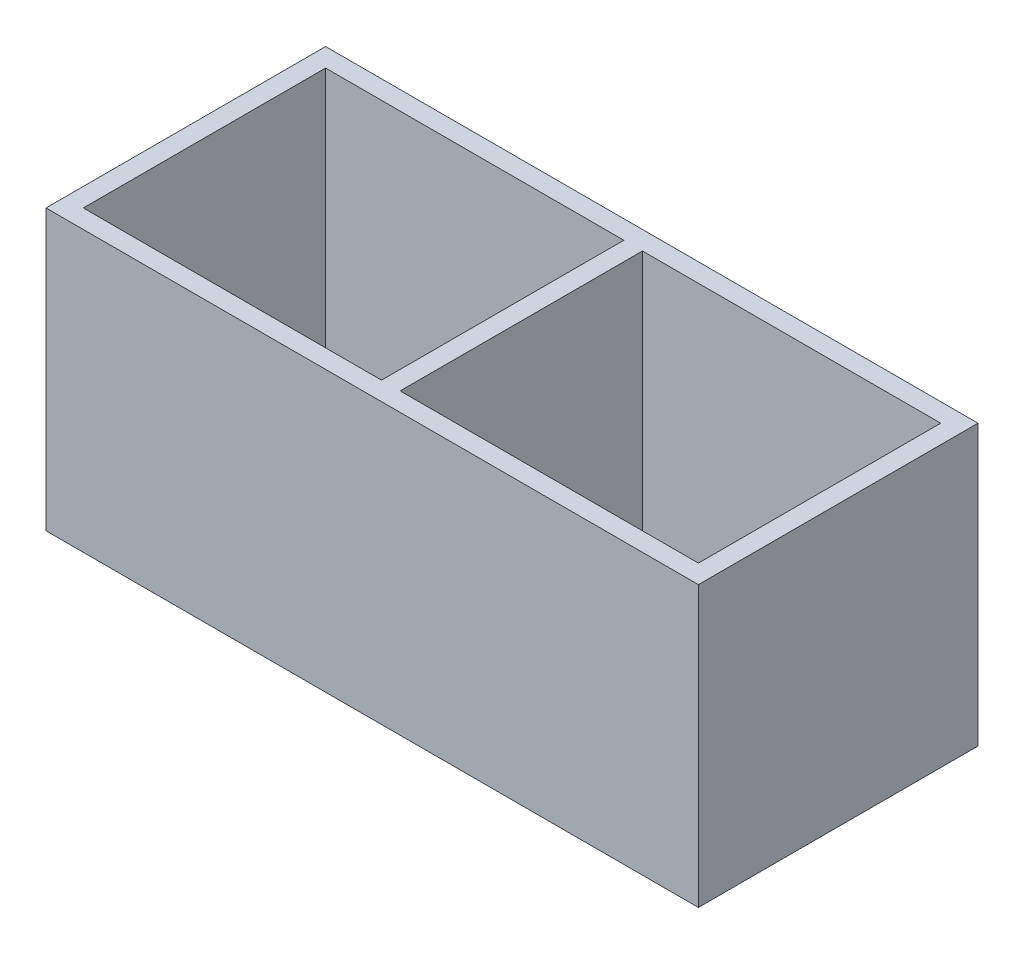
ISO-10303-21;
HEADER;
FILE_DESCRIPTION(('STEP AP214'),'2;1');
FILE_NAME('part.step','',(''),(''),'','','');
FILE_SCHEMA(('AUTOMOTIVE_DESIGN { 1 0 10303 214 1 1 1 1 }'));
ENDSEC;
DATA;
#1=APPLICATION_CONTEXT('core data for automotive mechanical design processes');
#2=APPLICATION_PROTOCOL_DEFINITION('international standard','automotive_design',2000,#1);
#3=PRODUCT_CONTEXT('',#1,'mechanical');
#4=PRODUCT('Part','Part','',(#3));
#5=PRODUCT_RELATED_PRODUCT_CATEGORY('part','',(#4));
#6=PRODUCT_DEFINITION_FORMATION('','',#4);
#7=PRODUCT_DEFINITION_CONTEXT('part definition',#1,'design');
#8=PRODUCT_DEFINITION('design','',#6,#7);
#9=PRODUCT_DEFINITION_SHAPE('','',#8);
#10=(LENGTH_UNIT() NAMED_UNIT(*) SI_UNIT(.MILLI.,.METRE.));
#11=(NAMED_UNIT(*) PLANE_ANGLE_UNIT() SI_UNIT($,.RADIAN.));
#12=(NAMED_UNIT(*) SI_UNIT($,.STERADIAN.) SOLID_ANGLE_UNIT());
#13=UNCERTAINTY_MEASURE_WITH_UNIT(LENGTH_MEASURE(1.E-05),#10,'distance_accuracy_value','');
#14=(GEOMETRIC_REPRESENTATION_CONTEXT(3) GLOBAL_UNCERTAINTY_ASSIGNED_CONTEXT((#13)) GLOBAL_UNIT_ASSIGNED_CONTEXT((#10,
#11,#12)) REPRESENTATION_CONTEXT('',''));
#15=CARTESIAN_POINT('',(0.,0.,0.));
#16=DIRECTION('',(0.,0.,1.));
#17=DIRECTION('',(1.,0.,0.));
#18=AXIS2_PLACEMENT_3D('',#15,#16,#17);
#19=CARTESIAN_POINT('',(0.,15.,0.));
#20=DIRECTION('',(0.,-1.,0.));
#21=DIRECTION('',(0.,0.,-1.));
#22=AXIS2_PLACEMENT_3D('',#19,#20,#21);
#23=PLANE('',#22);
#24=DIRECTION('',(-1.,0.,0.));
#25=VECTOR('',#24,1.);
#26=CARTESIAN_POINT('',(0.50000000000001,15.,-6.5));
#27=LINE('',#26,#25);
#28=CARTESIAN_POINT('',(16.5,15.,-6.5));
#29=VERTEX_POINT('',#28);
#30=CARTESIAN_POINT('',(0.50000000000001,15.,-6.5));
#31=VERTEX_POINT('',#30);
#32=EDGE_CURVE('E159',#29,#31,#27,.T.);
#33=ORIENTED_EDGE('',*,*,#32,.F.);
#34=DIRECTION('',(0.,0.,-1.));
#35=VECTOR('',#34,1.);
#36=CARTESIAN_POINT('',(16.5,15.,6.5));
#37=LINE('',#36,#35);
#38=CARTESIAN_POINT('',(16.5,15.,6.5));
#39=VERTEX_POINT('',#38);
#40=EDGE_CURVE('E167',#39,#29,#37,.T.);
#41=ORIENTED_EDGE('',*,*,#40,.F.);
#42=DIRECTION('',(1.,0.,0.));
#43=VECTOR('',#42,1.);
#44=CARTESIAN_POINT('',(0.50000000000001,15.,6.5));
#45=LINE('',#44,#43);
#46=CARTESIAN_POINT('',(0.50000000000001,15.,6.5));
#47=VERTEX_POINT('',#46);
#48=EDGE_CURVE('E164',#47,#39,#45,.T.);
#49=ORIENTED_EDGE('',*,*,#48,.F.);
#50=DIRECTION('',(0.,0.,1.));
#51=VECTOR('',#50,1.);
#52=CARTESIAN_POINT('',(0.50000000000001,15.,-6.5));
#53=LINE('',#52,#51);
#54=EDGE_CURVE('E161',#31,#47,#53,.T.);
#55=ORIENTED_EDGE('',*,*,#54,.F.);
#56=EDGE_LOOP('',(#33,#41,#49,#55));
#57=FACE_BOUND('',#56,.T.);
#58=DIRECTION('',(0.,0.,-1.));
#59=VECTOR('',#58,1.);
#60=CARTESIAN_POINT('',(17.5,15.,7.5));
#61=LINE('',#60,#59);
#62=CARTESIAN_POINT('',(17.5,15.,7.5));
#63=VERTEX_POINT('',#62);
#64=CARTESIAN_POINT('',(17.5,15.,-7.5));
#65=VERTEX_POINT('',#64);
#66=EDGE_CURVE('E190',#63,#65,#61,.T.);
#67=ORIENTED_EDGE('',*,*,#66,.T.);
#68=DIRECTION('',(-1.,0.,0.));
#69=VECTOR('',#68,1.);
#70=CARTESIAN_POINT('',(-17.5,15.,-7.5));
#71=LINE('',#70,#69);
#72=CARTESIAN_POINT('',(-17.5,15.,-7.5));
#73=VERTEX_POINT('',#72);
#74=EDGE_CURVE('E193',#65,#73,#71,.T.);
#75=ORIENTED_EDGE('',*,*,#74,.T.);
#76=DIRECTION('',(0.,0.,1.));
#77=VECTOR('',#76,1.);
#78=CARTESIAN_POINT('',(-17.5,15.,7.5));
#79=LINE('',#78,#77);
#80=CARTESIAN_POINT('',(-17.5,15.,7.5));
#81=VERTEX_POINT('',#80);
#82=EDGE_CURVE('E196',#73,#81,#79,.T.);
#83=ORIENTED_EDGE('',*,*,#82,.T.);
#84=DIRECTION('',(1.,0.,0.));
#85=VECTOR('',#84,1.);
#86=CARTESIAN_POINT('',(-17.5,15.,7.5));
#87=LINE('',#86,#85);
#88=EDGE_CURVE('E198',#81,#63,#87,.T.);
#89=ORIENTED_EDGE('',*,*,#88,.T.);
#90=EDGE_LOOP('',(#67,#75,#83,#89));
#91=FACE_BOUND('',#90,.T.);
#92=DIRECTION('',(0.,0.,1.));
#93=VECTOR('',#92,1.);
#94=CARTESIAN_POINT('',(-16.5,15.,6.5));
#95=LINE('',#94,#93);
#96=CARTESIAN_POINT('',(-16.5,15.,-6.5));
#97=VERTEX_POINT('',#96);
#98=CARTESIAN_POINT('',(-16.5,15.,6.5));
#99=VERTEX_POINT('',#98);
#100=EDGE_CURVE('E123',#97,#99,#95,.T.);
#101=ORIENTED_EDGE('',*,*,#100,.F.);
#102=DIRECTION('',(-1.,0.,0.));
#103=VECTOR('',#102,1.);
#104=CARTESIAN_POINT('',(-16.5,15.,-6.5));
#105=LINE('',#104,#103);
#106=CARTESIAN_POINT('',(-0.49999999999999,15.,-6.5));
#107=VERTEX_POINT('',#106);
#108=EDGE_CURVE('E145',#107,#97,#105,.T.);
#109=ORIENTED_EDGE('',*,*,#108,.F.);
#110=DIRECTION('',(0.,0.,-1.));
#111=VECTOR('',#110,1.);
#112=CARTESIAN_POINT('',(-0.49999999999999,15.,-6.5));
#113=LINE('',#112,#111);
#114=CARTESIAN_POINT('',(-0.49999999999999,15.,6.5));
#115=VERTEX_POINT('',#114);
#116=EDGE_CURVE('E143',#115,#107,#113,.T.);
#117=ORIENTED_EDGE('',*,*,#116,.F.);
#118=DIRECTION('',(1.,0.,0.));
#119=VECTOR('',#118,1.);
#120=CARTESIAN_POINT('',(-16.5,15.,6.5));
#121=LINE('',#120,#119);
#122=EDGE_CURVE('E131',#99,#115,#121,.T.);
#123=ORIENTED_EDGE('',*,*,#122,.F.);
#124=EDGE_LOOP('',(#101,#109,#117,#123));
#125=FACE_BOUND('',#124,.T.);
#126=ADVANCED_FACE('F34',(#57,#91,#125),#23,.F.);
#127=CARTESIAN_POINT('',(0.,0.,0.));
#128=DIRECTION('',(0.,-1.,0.));
#129=DIRECTION('',(0.,0.,-1.));
#130=AXIS2_PLACEMENT_3D('',#127,#128,#129);
#131=PLANE('',#130);
#132=DIRECTION('',(0.,0.,-1.));
#133=VECTOR('',#132,1.);
#134=CARTESIAN_POINT('',(16.5,0.,6.5));
#135=LINE('',#134,#133);
#136=CARTESIAN_POINT('',(16.5,0.,6.5));
#137=VERTEX_POINT('',#136);
#138=CARTESIAN_POINT('',(16.5,0.,-6.5));
#139=VERTEX_POINT('',#138);
#140=EDGE_CURVE('E162',#137,#139,#135,.T.);
#141=ORIENTED_EDGE('',*,*,#140,.T.);
#142=DIRECTION('',(-1.,0.,0.));
#143=VECTOR('',#142,1.);
#144=CARTESIAN_POINT('',(0.50000000000001,0.,-6.5));
#145=LINE('',#144,#143);
#146=CARTESIAN_POINT('',(0.50000000000001,0.,-6.5));
#147=VERTEX_POINT('',#146);
#148=EDGE_CURVE('E139',#139,#147,#145,.T.);
#149=ORIENTED_EDGE('',*,*,#148,.T.);
#150=DIRECTION('',(0.,0.,1.));
#151=VECTOR('',#150,1.);
#152=CARTESIAN_POINT('',(0.50000000000001,0.,-6.5));
#153=LINE('',#152,#151);
#154=CARTESIAN_POINT('',(0.50000000000001,0.,6.5));
#155=VERTEX_POINT('',#154);
#156=EDGE_CURVE('E172',#147,#155,#153,.T.);
#157=ORIENTED_EDGE('',*,*,#156,.T.);
#158=DIRECTION('',(1.,0.,0.));
#159=VECTOR('',#158,1.);
#160=CARTESIAN_POINT('',(0.50000000000001,0.,6.5));
#161=LINE('',#160,#159);
#162=EDGE_CURVE('E175',#155,#137,#161,.T.);
#163=ORIENTED_EDGE('',*,*,#162,.T.);
#164=EDGE_LOOP('',(#141,#149,#157,#163));
#165=FACE_BOUND('',#164,.T.);
#166=DIRECTION('',(0.,0.,-1.));
#167=VECTOR('',#166,1.);
#168=CARTESIAN_POINT('',(17.5,0.,7.5));
#169=LINE('',#168,#167);
#170=CARTESIAN_POINT('',(17.5,0.,7.5));
#171=VERTEX_POINT('',#170);
#172=CARTESIAN_POINT('',(17.5,0.,-7.5));
#173=VERTEX_POINT('',#172);
#174=EDGE_CURVE('E189',#171,#173,#169,.T.);
#175=ORIENTED_EDGE('',*,*,#174,.F.);
#176=DIRECTION('',(1.,0.,0.));
#177=VECTOR('',#176,1.);
#178=CARTESIAN_POINT('',(-17.5,0.,7.5));
#179=LINE('',#178,#177);
#180=CARTESIAN_POINT('',(-17.5,0.,7.5));
#181=VERTEX_POINT('',#180);
#182=EDGE_CURVE('E194',#181,#171,#179,.T.);
#183=ORIENTED_EDGE('',*,*,#182,.F.);
#184=DIRECTION('',(0.,0.,1.));
#185=VECTOR('',#184,1.);
#186=CARTESIAN_POINT('',(-17.5,0.,7.5));
#187=LINE('',#186,#185);
#188=CARTESIAN_POINT('',(-17.5,0.,-7.5));
#189=VERTEX_POINT('',#188);
#190=EDGE_CURVE('E205',#189,#181,#187,.T.);
#191=ORIENTED_EDGE('',*,*,#190,.F.);
#192=DIRECTION('',(-1.,0.,0.));
#193=VECTOR('',#192,1.);
#194=CARTESIAN_POINT('',(-17.5,0.,-7.5));
#195=LINE('',#194,#193);
#196=EDGE_CURVE('E203',#173,#189,#195,.T.);
#197=ORIENTED_EDGE('',*,*,#196,.F.);
#198=EDGE_LOOP('',(#175,#183,#191,#197));
#199=FACE_BOUND('',#198,.T.);
#200=DIRECTION('',(-1.,0.,0.));
#201=VECTOR('',#200,1.);
#202=CARTESIAN_POINT('',(-16.5,0.,-6.5));
#203=LINE('',#202,#201);
#204=CARTESIAN_POINT('',(-0.49999999999999,0.,-6.5));
#205=VERTEX_POINT('',#204);
#206=CARTESIAN_POINT('',(-16.5,0.,-6.5));
#207=VERTEX_POINT('',#206);
#208=EDGE_CURVE('E132',#205,#207,#203,.T.);
#209=ORIENTED_EDGE('',*,*,#208,.T.);
#210=DIRECTION('',(0.,0.,1.));
#211=VECTOR('',#210,1.);
#212=CARTESIAN_POINT('',(-16.5,0.,6.5));
#213=LINE('',#212,#211);
#214=CARTESIAN_POINT('',(-16.5,0.,6.5));
#215=VERTEX_POINT('',#214);
#216=EDGE_CURVE('E57',#207,#215,#213,.T.);
#217=ORIENTED_EDGE('',*,*,#216,.T.);
#218=DIRECTION('',(1.,0.,0.));
#219=VECTOR('',#218,1.);
#220=CARTESIAN_POINT('',(-16.5,0.,6.5));
#221=LINE('',#220,#219);
#222=CARTESIAN_POINT('',(-0.49999999999999,0.,6.5));
#223=VERTEX_POINT('',#222);
#224=EDGE_CURVE('E138',#215,#223,#221,.T.);
#225=ORIENTED_EDGE('',*,*,#224,.T.);
#226=DIRECTION('',(0.,0.,-1.));
#227=VECTOR('',#226,1.);
#228=CARTESIAN_POINT('',(-0.49999999999999,0.,-6.5));
#229=LINE('',#228,#227);
#230=EDGE_CURVE('E151',#223,#205,#229,.T.);
#231=ORIENTED_EDGE('',*,*,#230,.T.);
#232=EDGE_LOOP('',(#209,#217,#225,#231));
#233=FACE_BOUND('',#232,.T.);
#234=ADVANCED_FACE('F223',(#165,#199,#233),#131,.T.);
#235=CARTESIAN_POINT('',(17.5,15.,7.5));
#236=DIRECTION('',(-1.,0.,0.));
#237=DIRECTION('',(0.,0.,1.));
#238=AXIS2_PLACEMENT_3D('',#235,#236,#237);
#239=PLANE('',#238);
#240=ORIENTED_EDGE('',*,*,#174,.T.);
#241=DIRECTION('',(0.,-1.,0.));
#242=VECTOR('',#241,1.);
#243=CARTESIAN_POINT('',(17.5,15.,-7.5));
#244=LINE('',#243,#242);
#245=EDGE_CURVE('E11',#65,#173,#244,.T.);
#246=ORIENTED_EDGE('',*,*,#245,.F.);
#247=ORIENTED_EDGE('',*,*,#66,.F.);
#248=DIRECTION('',(0.,-1.,0.));
#249=VECTOR('',#248,1.);
#250=CARTESIAN_POINT('',(17.5,15.,7.5));
#251=LINE('',#250,#249);
#252=EDGE_CURVE('E200',#63,#171,#251,.T.);
#253=ORIENTED_EDGE('',*,*,#252,.T.);
#254=EDGE_LOOP('',(#240,#246,#247,#253));
#255=FACE_BOUND('',#254,.T.);
#256=ADVANCED_FACE('F36',(#255),#239,.F.);
#257=CARTESIAN_POINT('',(-17.5,15.,-7.5));
#258=DIRECTION('',(0.,0.,1.));
#259=DIRECTION('',(1.,0.,0.));
#260=AXIS2_PLACEMENT_3D('',#257,#258,#259);
#261=PLANE('',#260);
#262=ORIENTED_EDGE('',*,*,#196,.T.);
#263=DIRECTION('',(0.,-1.,0.));
#264=VECTOR('',#263,1.);
#265=CARTESIAN_POINT('',(-17.5,15.,-7.5));
#266=LINE('',#265,#264);
#267=EDGE_CURVE('E42',#73,#189,#266,.T.);
#268=ORIENTED_EDGE('',*,*,#267,.F.);
#269=ORIENTED_EDGE('',*,*,#74,.F.);
#270=ORIENTED_EDGE('',*,*,#245,.T.);
#271=EDGE_LOOP('',(#262,#268,#269,#270));
#272=FACE_BOUND('',#271,.T.);
#273=ADVANCED_FACE('F233',(#272),#261,.F.);
#274=CARTESIAN_POINT('',(-17.5,15.,7.5));
#275=DIRECTION('',(1.,0.,0.));
#276=DIRECTION('',(0.,0.,-1.));
#277=AXIS2_PLACEMENT_3D('',#274,#275,#276);
#278=PLANE('',#277);
#279=ORIENTED_EDGE('',*,*,#190,.T.);
#280=DIRECTION('',(0.,-1.,0.));
#281=VECTOR('',#280,1.);
#282=CARTESIAN_POINT('',(-17.5,15.,7.5));
#283=LINE('',#282,#281);
#284=EDGE_CURVE('E210',#81,#181,#283,.T.);
#285=ORIENTED_EDGE('',*,*,#284,.F.);
#286=ORIENTED_EDGE('',*,*,#82,.F.);
#287=ORIENTED_EDGE('',*,*,#267,.T.);
#288=EDGE_LOOP('',(#279,#285,#286,#287));
#289=FACE_BOUND('',#288,.T.);
#290=ADVANCED_FACE('F217',(#289),#278,.F.);
#291=CARTESIAN_POINT('',(-17.5,15.,7.5));
#292=DIRECTION('',(0.,0.,-1.));
#293=DIRECTION('',(-1.,0.,0.));
#294=AXIS2_PLACEMENT_3D('',#291,#292,#293);
#295=PLANE('',#294);
#296=ORIENTED_EDGE('',*,*,#182,.T.);
#297=ORIENTED_EDGE('',*,*,#252,.F.);
#298=ORIENTED_EDGE('',*,*,#88,.F.);
#299=ORIENTED_EDGE('',*,*,#284,.T.);
#300=EDGE_LOOP('',(#296,#297,#298,#299));
#301=FACE_BOUND('',#300,.T.);
#302=ADVANCED_FACE('F227',(#301),#295,.F.);
#303=CARTESIAN_POINT('',(0.50000000000001,15.,-6.5));
#304=DIRECTION('',(0.,0.,1.));
#305=DIRECTION('',(1.,0.,0.));
#306=AXIS2_PLACEMENT_3D('',#303,#304,#305);
#307=PLANE('',#306);
#308=ORIENTED_EDGE('',*,*,#148,.F.);
#309=DIRECTION('',(0.,-1.,0.));
#310=VECTOR('',#309,1.);
#311=CARTESIAN_POINT('',(16.5,15.,-6.5));
#312=LINE('',#311,#310);
#313=EDGE_CURVE('E169',#29,#139,#312,.T.);
#314=ORIENTED_EDGE('',*,*,#313,.F.);
#315=ORIENTED_EDGE('',*,*,#32,.T.);
#316=DIRECTION('',(0.,-1.,0.));
#317=VECTOR('',#316,1.);
#318=CARTESIAN_POINT('',(0.50000000000001,15.,-6.5));
#319=LINE('',#318,#317);
#320=EDGE_CURVE('E186',#31,#147,#319,.T.);
#321=ORIENTED_EDGE('',*,*,#320,.T.);
#322=EDGE_LOOP('',(#308,#314,#315,#321));
#323=FACE_BOUND('',#322,.T.);
#324=ADVANCED_FACE('F250',(#323),#307,.T.);
#325=CARTESIAN_POINT('',(0.50000000000001,15.,-6.5));
#326=DIRECTION('',(1.,0.,0.));
#327=DIRECTION('',(0.,0.,-1.));
#328=AXIS2_PLACEMENT_3D('',#325,#326,#327);
#329=PLANE('',#328);
#330=ORIENTED_EDGE('',*,*,#156,.F.);
#331=ORIENTED_EDGE('',*,*,#320,.F.);
#332=ORIENTED_EDGE('',*,*,#54,.T.);
#333=DIRECTION('',(0.,-1.,0.));
#334=VECTOR('',#333,1.);
#335=CARTESIAN_POINT('',(0.50000000000001,15.,6.5));
#336=LINE('',#335,#334);
#337=EDGE_CURVE('E184',#47,#155,#336,.T.);
#338=ORIENTED_EDGE('',*,*,#337,.T.);
#339=EDGE_LOOP('',(#330,#331,#332,#338));
#340=FACE_BOUND('',#339,.T.);
#341=ADVANCED_FACE('F257',(#340),#329,.T.);
#342=CARTESIAN_POINT('',(0.50000000000001,15.,6.5));
#343=DIRECTION('',(0.,0.,-1.));
#344=DIRECTION('',(-1.,0.,0.));
#345=AXIS2_PLACEMENT_3D('',#342,#343,#344);
#346=PLANE('',#345);
#347=ORIENTED_EDGE('',*,*,#162,.F.);
#348=ORIENTED_EDGE('',*,*,#337,.F.);
#349=ORIENTED_EDGE('',*,*,#48,.T.);
#350=DIRECTION('',(0.,-1.,0.));
#351=VECTOR('',#350,1.);
#352=CARTESIAN_POINT('',(16.5,15.,6.5));
#353=LINE('',#352,#351);
#354=EDGE_CURVE('E182',#39,#137,#353,.T.);
#355=ORIENTED_EDGE('',*,*,#354,.T.);
#356=EDGE_LOOP('',(#347,#348,#349,#355));
#357=FACE_BOUND('',#356,.T.);
#358=ADVANCED_FACE('F262',(#357),#346,.T.);
#359=CARTESIAN_POINT('',(16.5,15.,6.5));
#360=DIRECTION('',(-1.,0.,0.));
#361=DIRECTION('',(0.,0.,1.));
#362=AXIS2_PLACEMENT_3D('',#359,#360,#361);
#363=PLANE('',#362);
#364=ORIENTED_EDGE('',*,*,#140,.F.);
#365=ORIENTED_EDGE('',*,*,#354,.F.);
#366=ORIENTED_EDGE('',*,*,#40,.T.);
#367=ORIENTED_EDGE('',*,*,#313,.T.);
#368=EDGE_LOOP('',(#364,#365,#366,#367));
#369=FACE_BOUND('',#368,.T.);
#370=ADVANCED_FACE('F268',(#369),#363,.T.);
#371=CARTESIAN_POINT('',(-16.5,15.,6.5));
#372=DIRECTION('',(1.,0.,0.));
#373=DIRECTION('',(0.,0.,-1.));
#374=AXIS2_PLACEMENT_3D('',#371,#372,#373);
#375=PLANE('',#374);
#376=ORIENTED_EDGE('',*,*,#216,.F.);
#377=DIRECTION('',(0.,-1.,0.));
#378=VECTOR('',#377,1.);
#379=CARTESIAN_POINT('',(-16.5,15.,-6.5));
#380=LINE('',#379,#378);
#381=EDGE_CURVE('E127',#97,#207,#380,.T.);
#382=ORIENTED_EDGE('',*,*,#381,.F.);
#383=ORIENTED_EDGE('',*,*,#100,.T.);
#384=DIRECTION('',(0.,-1.,0.));
#385=VECTOR('',#384,1.);
#386=CARTESIAN_POINT('',(-16.5,15.,6.5));
#387=LINE('',#386,#385);
#388=EDGE_CURVE('E126',#99,#215,#387,.T.);
#389=ORIENTED_EDGE('',*,*,#388,.T.);
#390=EDGE_LOOP('',(#376,#382,#383,#389));
#391=FACE_BOUND('',#390,.T.);
#392=ADVANCED_FACE('F125',(#391),#375,.T.);
#393=CARTESIAN_POINT('',(-16.5,15.,6.5));
#394=DIRECTION('',(0.,0.,-1.));
#395=DIRECTION('',(-1.,0.,0.));
#396=AXIS2_PLACEMENT_3D('',#393,#394,#395);
#397=PLANE('',#396);
#398=ORIENTED_EDGE('',*,*,#224,.F.);
#399=ORIENTED_EDGE('',*,*,#388,.F.);
#400=ORIENTED_EDGE('',*,*,#122,.T.);
#401=DIRECTION('',(0.,-1.,0.));
#402=VECTOR('',#401,1.);
#403=CARTESIAN_POINT('',(-0.49999999999999,15.,6.5));
#404=LINE('',#403,#402);
#405=EDGE_CURVE('E140',#115,#223,#404,.T.);
#406=ORIENTED_EDGE('',*,*,#405,.T.);
#407=EDGE_LOOP('',(#398,#399,#400,#406));
#408=FACE_BOUND('',#407,.T.);
#409=ADVANCED_FACE('F135',(#408),#397,.T.);
#410=CARTESIAN_POINT('',(-0.49999999999999,15.,-6.5));
#411=DIRECTION('',(-1.,0.,0.));
#412=DIRECTION('',(0.,0.,1.));
#413=AXIS2_PLACEMENT_3D('',#410,#411,#412);
#414=PLANE('',#413);
#415=ORIENTED_EDGE('',*,*,#230,.F.);
#416=ORIENTED_EDGE('',*,*,#405,.F.);
#417=ORIENTED_EDGE('',*,*,#116,.T.);
#418=DIRECTION('',(0.,-1.,0.));
#419=VECTOR('',#418,1.);
#420=CARTESIAN_POINT('',(-0.49999999999999,15.,-6.5));
#421=LINE('',#420,#419);
#422=EDGE_CURVE('E49',#107,#205,#421,.T.);
#423=ORIENTED_EDGE('',*,*,#422,.T.);
#424=EDGE_LOOP('',(#415,#416,#417,#423));
#425=FACE_BOUND('',#424,.T.);
#426=ADVANCED_FACE('F286',(#425),#414,.T.);
#427=CARTESIAN_POINT('',(-16.5,15.,-6.5));
#428=DIRECTION('',(0.,0.,1.));
#429=DIRECTION('',(1.,0.,0.));
#430=AXIS2_PLACEMENT_3D('',#427,#428,#429);
#431=PLANE('',#430);
#432=ORIENTED_EDGE('',*,*,#208,.F.);
#433=ORIENTED_EDGE('',*,*,#422,.F.);
#434=ORIENTED_EDGE('',*,*,#108,.T.);
#435=ORIENTED_EDGE('',*,*,#381,.T.);
#436=EDGE_LOOP('',(#432,#433,#434,#435));
#437=FACE_BOUND('',#436,.T.);
#438=ADVANCED_FACE('F289',(#437),#431,.T.);
#439=CLOSED_SHELL('',(#126,#234,#256,#273,#290,#302,#324,#341,#358,#370,#392,#409,#426,#438));
#440=MANIFOLD_SOLID_BREP('B2',#439);
#441=ADVANCED_BREP_SHAPE_REPRESENTATION('',(#18,#440),#14);
#442=SHAPE_DEFINITION_REPRESENTATION(#9,#441);
ENDSEC;
END-ISO-10303-21;
